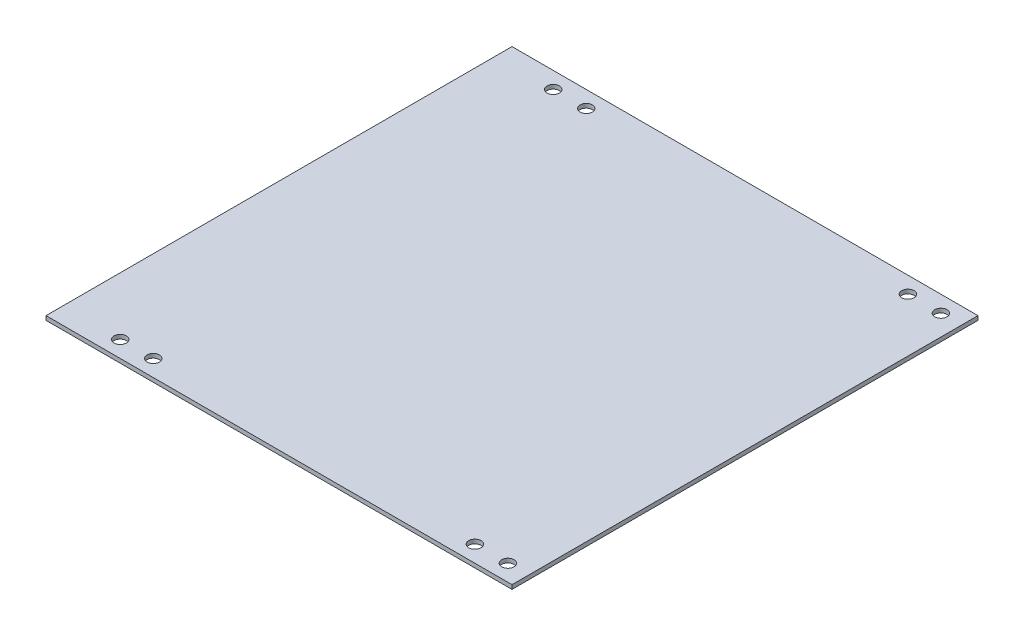
ISO-10303-21;
HEADER;
FILE_DESCRIPTION(('STEP AP214'),'2;1');
FILE_NAME('part.step','',(''),(''),'','','');
FILE_SCHEMA(('AUTOMOTIVE_DESIGN { 1 0 10303 214 1 1 1 1 }'));
ENDSEC;
DATA;
#1=APPLICATION_CONTEXT('core data for automotive mechanical design processes');
#2=APPLICATION_PROTOCOL_DEFINITION('international standard','automotive_design',2000,#1);
#3=PRODUCT_CONTEXT('',#1,'mechanical');
#4=PRODUCT('Part','Part','',(#3));
#5=PRODUCT_RELATED_PRODUCT_CATEGORY('part','',(#4));
#6=PRODUCT_DEFINITION_FORMATION('','',#4);
#7=PRODUCT_DEFINITION_CONTEXT('part definition',#1,'design');
#8=PRODUCT_DEFINITION('design','',#6,#7);
#9=PRODUCT_DEFINITION_SHAPE('','',#8);
#10=(LENGTH_UNIT() NAMED_UNIT(*) SI_UNIT(.MILLI.,.METRE.));
#11=(NAMED_UNIT(*) PLANE_ANGLE_UNIT() SI_UNIT($,.RADIAN.));
#12=(NAMED_UNIT(*) SI_UNIT($,.STERADIAN.) SOLID_ANGLE_UNIT());
#13=UNCERTAINTY_MEASURE_WITH_UNIT(LENGTH_MEASURE(1.E-05),#10,'distance_accuracy_value','');
#14=(GEOMETRIC_REPRESENTATION_CONTEXT(3) GLOBAL_UNCERTAINTY_ASSIGNED_CONTEXT((#13)) GLOBAL_UNIT_ASSIGNED_CONTEXT((#10,
#11,#12)) REPRESENTATION_CONTEXT('',''));
#15=CARTESIAN_POINT('',(0.,0.,0.));
#16=DIRECTION('',(0.,0.,1.));
#17=DIRECTION('',(1.,0.,0.));
#18=AXIS2_PLACEMENT_3D('',#15,#16,#17);
#19=CARTESIAN_POINT('',(0.,3.175,0.));
#20=DIRECTION('',(1.,0.,0.));
#21=DIRECTION('',(0.,0.,-1.));
#22=AXIS2_PLACEMENT_3D('',#19,#20,#21);
#23=PLANE('',#22);
#24=DIRECTION('',(0.,0.,1.));
#25=VECTOR('',#24,1.);
#26=CARTESIAN_POINT('',(0.,0.,0.));
#27=LINE('',#26,#25);
#28=CARTESIAN_POINT('',(0.,0.,-358.775));
#29=VERTEX_POINT('',#28);
#30=CARTESIAN_POINT('',(0.,0.,0.));
#31=VERTEX_POINT('',#30);
#32=EDGE_CURVE('E102',#29,#31,#27,.T.);
#33=ORIENTED_EDGE('',*,*,#32,.T.);
#34=DIRECTION('',(0.,-1.,0.));
#35=VECTOR('',#34,1.);
#36=CARTESIAN_POINT('',(0.,3.175,0.));
#37=LINE('',#36,#35);
#38=CARTESIAN_POINT('',(0.,3.175,0.));
#39=VERTEX_POINT('',#38);
#40=EDGE_CURVE('E11',#39,#31,#37,.T.);
#41=ORIENTED_EDGE('',*,*,#40,.F.);
#42=DIRECTION('',(0.,0.,1.));
#43=VECTOR('',#42,1.);
#44=CARTESIAN_POINT('',(0.,3.175,0.));
#45=LINE('',#44,#43);
#46=CARTESIAN_POINT('',(0.,3.175,-358.775));
#47=VERTEX_POINT('',#46);
#48=EDGE_CURVE('E90',#47,#39,#45,.T.);
#49=ORIENTED_EDGE('',*,*,#48,.F.);
#50=DIRECTION('',(0.,-1.,0.));
#51=VECTOR('',#50,1.);
#52=CARTESIAN_POINT('',(0.,3.175,-358.775));
#53=LINE('',#52,#51);
#54=EDGE_CURVE('E98',#47,#29,#53,.T.);
#55=ORIENTED_EDGE('',*,*,#54,.T.);
#56=EDGE_LOOP('',(#33,#41,#49,#55));
#57=FACE_BOUND('',#56,.T.);
#58=ADVANCED_FACE('F39',(#57),#23,.F.);
#59=CARTESIAN_POINT('',(0.,3.175,0.));
#60=DIRECTION('',(0.,0.,-1.));
#61=DIRECTION('',(-1.,0.,0.));
#62=AXIS2_PLACEMENT_3D('',#59,#60,#61);
#63=PLANE('',#62);
#64=DIRECTION('',(1.,0.,0.));
#65=VECTOR('',#64,1.);
#66=CARTESIAN_POINT('',(0.,0.,0.));
#67=LINE('',#66,#65);
#68=CARTESIAN_POINT('',(358.775,0.,0.));
#69=VERTEX_POINT('',#68);
#70=EDGE_CURVE('E94',#31,#69,#67,.T.);
#71=ORIENTED_EDGE('',*,*,#70,.T.);
#72=DIRECTION('',(0.,-1.,0.));
#73=VECTOR('',#72,1.);
#74=CARTESIAN_POINT('',(358.775,3.175,0.));
#75=LINE('',#74,#73);
#76=CARTESIAN_POINT('',(358.775,3.175,0.));
#77=VERTEX_POINT('',#76);
#78=EDGE_CURVE('E47',#77,#69,#75,.T.);
#79=ORIENTED_EDGE('',*,*,#78,.F.);
#80=DIRECTION('',(1.,0.,0.));
#81=VECTOR('',#80,1.);
#82=CARTESIAN_POINT('',(0.,3.175,0.));
#83=LINE('',#82,#81);
#84=EDGE_CURVE('E85',#39,#77,#83,.T.);
#85=ORIENTED_EDGE('',*,*,#84,.F.);
#86=ORIENTED_EDGE('',*,*,#40,.T.);
#87=EDGE_LOOP('',(#71,#79,#85,#86));
#88=FACE_BOUND('',#87,.T.);
#89=ADVANCED_FACE('F93',(#88),#63,.F.);
#90=CARTESIAN_POINT('',(358.775,3.175,0.));
#91=DIRECTION('',(-1.,0.,0.));
#92=DIRECTION('',(0.,0.,1.));
#93=AXIS2_PLACEMENT_3D('',#90,#91,#92);
#94=PLANE('',#93);
#95=DIRECTION('',(0.,0.,-1.));
#96=VECTOR('',#95,1.);
#97=CARTESIAN_POINT('',(358.775,0.,0.));
#98=LINE('',#97,#96);
#99=CARTESIAN_POINT('',(358.775,0.,-358.775));
#100=VERTEX_POINT('',#99);
#101=EDGE_CURVE('E72',#69,#100,#98,.T.);
#102=ORIENTED_EDGE('',*,*,#101,.T.);
#103=DIRECTION('',(0.,-1.,0.));
#104=VECTOR('',#103,1.);
#105=CARTESIAN_POINT('',(358.775,3.175,-358.775));
#106=LINE('',#105,#104);
#107=CARTESIAN_POINT('',(358.775,3.175,-358.775));
#108=VERTEX_POINT('',#107);
#109=EDGE_CURVE('E95',#108,#100,#106,.T.);
#110=ORIENTED_EDGE('',*,*,#109,.F.);
#111=DIRECTION('',(0.,0.,-1.));
#112=VECTOR('',#111,1.);
#113=CARTESIAN_POINT('',(358.775,3.175,0.));
#114=LINE('',#113,#112);
#115=EDGE_CURVE('E88',#77,#108,#114,.T.);
#116=ORIENTED_EDGE('',*,*,#115,.F.);
#117=ORIENTED_EDGE('',*,*,#78,.T.);
#118=EDGE_LOOP('',(#102,#110,#116,#117));
#119=FACE_BOUND('',#118,.T.);
#120=ADVANCED_FACE('F96',(#119),#94,.F.);
#121=CARTESIAN_POINT('',(0.,3.175,-358.775));
#122=DIRECTION('',(0.,0.,1.));
#123=DIRECTION('',(1.,0.,0.));
#124=AXIS2_PLACEMENT_3D('',#121,#122,#123);
#125=PLANE('',#124);
#126=DIRECTION('',(-1.,0.,0.));
#127=VECTOR('',#126,1.);
#128=CARTESIAN_POINT('',(0.,0.,-358.775));
#129=LINE('',#128,#127);
#130=EDGE_CURVE('E78',#100,#29,#129,.T.);
#131=ORIENTED_EDGE('',*,*,#130,.T.);
#132=ORIENTED_EDGE('',*,*,#54,.F.);
#133=DIRECTION('',(-1.,0.,0.));
#134=VECTOR('',#133,1.);
#135=CARTESIAN_POINT('',(0.,3.175,-358.775));
#136=LINE('',#135,#134);
#137=EDGE_CURVE('E55',#108,#47,#136,.T.);
#138=ORIENTED_EDGE('',*,*,#137,.F.);
#139=ORIENTED_EDGE('',*,*,#109,.T.);
#140=EDGE_LOOP('',(#131,#132,#138,#139));
#141=FACE_BOUND('',#140,.T.);
#142=ADVANCED_FACE('F110',(#141),#125,.F.);
#143=CARTESIAN_POINT('',(0.,3.175,0.));
#144=DIRECTION('',(0.,-1.,0.));
#145=DIRECTION('',(0.,0.,-1.));
#146=AXIS2_PLACEMENT_3D('',#143,#144,#145);
#147=PLANE('',#146);
#148=CARTESIAN_POINT('',(44.4500000000001,3.175,-346.075));
#149=DIRECTION('',(0.,-1.,0.));
#150=DIRECTION('',(0.,0.,-1.));
#151=AXIS2_PLACEMENT_3D('',#148,#149,#150);
#152=CIRCLE('',#151,4.7625);
#153=CARTESIAN_POINT('',(44.4500000000001,3.175,-350.8375));
#154=VERTEX_POINT('',#153);
#155=EDGE_CURVE('E158',#154,#154,#152,.T.);
#156=ORIENTED_EDGE('',*,*,#155,.T.);
#157=EDGE_LOOP('',(#156));
#158=FACE_BOUND('',#157,.T.);
#159=CARTESIAN_POINT('',(69.8500000000001,3.175,-346.075));
#160=DIRECTION('',(0.,-1.,0.));
#161=DIRECTION('',(0.,0.,-1.));
#162=AXIS2_PLACEMENT_3D('',#159,#160,#161);
#163=CIRCLE('',#162,4.7625);
#164=CARTESIAN_POINT('',(69.8500000000001,3.175,-350.8375));
#165=VERTEX_POINT('',#164);
#166=EDGE_CURVE('E152',#165,#165,#163,.T.);
#167=ORIENTED_EDGE('',*,*,#166,.T.);
#168=EDGE_LOOP('',(#167));
#169=FACE_BOUND('',#168,.T.);
#170=CARTESIAN_POINT('',(317.5,3.175,-346.075));
#171=DIRECTION('',(0.,-1.,0.));
#172=DIRECTION('',(0.,0.,-1.));
#173=AXIS2_PLACEMENT_3D('',#170,#171,#172);
#174=CIRCLE('',#173,4.76250000000001);
#175=CARTESIAN_POINT('',(317.5,3.175,-350.8375));
#176=VERTEX_POINT('',#175);
#177=EDGE_CURVE('E146',#176,#176,#174,.T.);
#178=ORIENTED_EDGE('',*,*,#177,.T.);
#179=EDGE_LOOP('',(#178));
#180=FACE_BOUND('',#179,.T.);
#181=CARTESIAN_POINT('',(342.9,3.175,-346.075));
#182=DIRECTION('',(0.,-1.,0.));
#183=DIRECTION('',(0.,0.,-1.));
#184=AXIS2_PLACEMENT_3D('',#181,#182,#183);
#185=CIRCLE('',#184,4.76250000000001);
#186=CARTESIAN_POINT('',(342.9,3.175,-350.8375));
#187=VERTEX_POINT('',#186);
#188=EDGE_CURVE('E140',#187,#187,#185,.T.);
#189=ORIENTED_EDGE('',*,*,#188,.T.);
#190=EDGE_LOOP('',(#189));
#191=FACE_BOUND('',#190,.T.);
#192=CARTESIAN_POINT('',(44.4500000000001,3.175,-12.7));
#193=DIRECTION('',(0.,1.,0.));
#194=DIRECTION('',(0.,0.,1.));
#195=AXIS2_PLACEMENT_3D('',#192,#193,#194);
#196=CIRCLE('',#195,4.7625);
#197=CARTESIAN_POINT('',(44.4500000000001,3.175,-7.9375));
#198=VERTEX_POINT('',#197);
#199=EDGE_CURVE('E135',#198,#198,#196,.T.);
#200=ORIENTED_EDGE('',*,*,#199,.F.);
#201=EDGE_LOOP('',(#200));
#202=FACE_BOUND('',#201,.T.);
#203=CARTESIAN_POINT('',(69.8500000000001,3.175,-12.7000000000001));
#204=DIRECTION('',(0.,1.,0.));
#205=DIRECTION('',(0.,0.,1.));
#206=AXIS2_PLACEMENT_3D('',#203,#204,#205);
#207=CIRCLE('',#206,4.7625);
#208=CARTESIAN_POINT('',(69.8500000000001,3.175,-7.93750000000006));
#209=VERTEX_POINT('',#208);
#210=EDGE_CURVE('E129',#209,#209,#207,.T.);
#211=ORIENTED_EDGE('',*,*,#210,.F.);
#212=EDGE_LOOP('',(#211));
#213=FACE_BOUND('',#212,.T.);
#214=CARTESIAN_POINT('',(317.5,3.175,-12.7));
#215=DIRECTION('',(0.,1.,0.));
#216=DIRECTION('',(0.,0.,1.));
#217=AXIS2_PLACEMENT_3D('',#214,#215,#216);
#218=CIRCLE('',#217,4.76250000000001);
#219=CARTESIAN_POINT('',(317.5,3.175,-7.93749999999999));
#220=VERTEX_POINT('',#219);
#221=EDGE_CURVE('E123',#220,#220,#218,.T.);
#222=ORIENTED_EDGE('',*,*,#221,.F.);
#223=EDGE_LOOP('',(#222));
#224=FACE_BOUND('',#223,.T.);
#225=CARTESIAN_POINT('',(342.9,3.175,-12.7));
#226=DIRECTION('',(0.,1.,0.));
#227=DIRECTION('',(0.,0.,1.));
#228=AXIS2_PLACEMENT_3D('',#225,#226,#227);
#229=CIRCLE('',#228,4.76250000000001);
#230=CARTESIAN_POINT('',(342.9,3.175,-7.93749999999999));
#231=VERTEX_POINT('',#230);
#232=EDGE_CURVE('E116',#231,#231,#229,.T.);
#233=ORIENTED_EDGE('',*,*,#232,.F.);
#234=EDGE_LOOP('',(#233));
#235=FACE_BOUND('',#234,.T.);
#236=ORIENTED_EDGE('',*,*,#48,.T.);
#237=ORIENTED_EDGE('',*,*,#84,.T.);
#238=ORIENTED_EDGE('',*,*,#115,.T.);
#239=ORIENTED_EDGE('',*,*,#137,.T.);
#240=EDGE_LOOP('',(#236,#237,#238,#239));
#241=FACE_BOUND('',#240,.T.);
#242=ADVANCED_FACE('F86',(#158,#169,#180,#191,#202,#213,#224,#235,#241),#147,.F.);
#243=CARTESIAN_POINT('',(0.,0.,0.));
#244=DIRECTION('',(0.,-1.,0.));
#245=DIRECTION('',(0.,0.,-1.));
#246=AXIS2_PLACEMENT_3D('',#243,#244,#245);
#247=PLANE('',#246);
#248=CARTESIAN_POINT('',(44.4500000000001,0.,-346.075));
#249=DIRECTION('',(0.,-1.,0.));
#250=DIRECTION('',(0.,0.,-1.));
#251=AXIS2_PLACEMENT_3D('',#248,#249,#250);
#252=CIRCLE('',#251,4.7625);
#253=CARTESIAN_POINT('',(44.4500000000001,0.,-350.8375));
#254=VERTEX_POINT('',#253);
#255=EDGE_CURVE('E120',#254,#254,#252,.T.);
#256=ORIENTED_EDGE('',*,*,#255,.F.);
#257=EDGE_LOOP('',(#256));
#258=FACE_BOUND('',#257,.T.);
#259=CARTESIAN_POINT('',(69.8500000000001,0.,-346.075));
#260=DIRECTION('',(0.,-1.,0.));
#261=DIRECTION('',(0.,0.,-1.));
#262=AXIS2_PLACEMENT_3D('',#259,#260,#261);
#263=CIRCLE('',#262,4.7625);
#264=CARTESIAN_POINT('',(69.8500000000001,0.,-350.8375));
#265=VERTEX_POINT('',#264);
#266=EDGE_CURVE('E155',#265,#265,#263,.T.);
#267=ORIENTED_EDGE('',*,*,#266,.F.);
#268=EDGE_LOOP('',(#267));
#269=FACE_BOUND('',#268,.T.);
#270=CARTESIAN_POINT('',(317.5,0.,-346.075));
#271=DIRECTION('',(0.,-1.,0.));
#272=DIRECTION('',(0.,0.,-1.));
#273=AXIS2_PLACEMENT_3D('',#270,#271,#272);
#274=CIRCLE('',#273,4.76250000000001);
#275=CARTESIAN_POINT('',(317.5,0.,-350.8375));
#276=VERTEX_POINT('',#275);
#277=EDGE_CURVE('E149',#276,#276,#274,.T.);
#278=ORIENTED_EDGE('',*,*,#277,.F.);
#279=EDGE_LOOP('',(#278));
#280=FACE_BOUND('',#279,.T.);
#281=CARTESIAN_POINT('',(342.9,0.,-346.075));
#282=DIRECTION('',(0.,-1.,0.));
#283=DIRECTION('',(0.,0.,-1.));
#284=AXIS2_PLACEMENT_3D('',#281,#282,#283);
#285=CIRCLE('',#284,4.76250000000001);
#286=CARTESIAN_POINT('',(342.9,0.,-350.8375));
#287=VERTEX_POINT('',#286);
#288=EDGE_CURVE('E143',#287,#287,#285,.T.);
#289=ORIENTED_EDGE('',*,*,#288,.F.);
#290=EDGE_LOOP('',(#289));
#291=FACE_BOUND('',#290,.T.);
#292=CARTESIAN_POINT('',(44.4500000000001,0.,-12.7));
#293=DIRECTION('',(0.,1.,0.));
#294=DIRECTION('',(0.,0.,1.));
#295=AXIS2_PLACEMENT_3D('',#292,#293,#294);
#296=CIRCLE('',#295,4.7625);
#297=CARTESIAN_POINT('',(44.4500000000001,0.,-7.9375));
#298=VERTEX_POINT('',#297);
#299=EDGE_CURVE('E105',#298,#298,#296,.T.);
#300=ORIENTED_EDGE('',*,*,#299,.T.);
#301=EDGE_LOOP('',(#300));
#302=FACE_BOUND('',#301,.T.);
#303=CARTESIAN_POINT('',(69.8500000000001,0.,-12.7000000000001));
#304=DIRECTION('',(0.,1.,0.));
#305=DIRECTION('',(0.,0.,1.));
#306=AXIS2_PLACEMENT_3D('',#303,#304,#305);
#307=CIRCLE('',#306,4.7625);
#308=CARTESIAN_POINT('',(69.8500000000001,0.,-7.93750000000006));
#309=VERTEX_POINT('',#308);
#310=EDGE_CURVE('E132',#309,#309,#307,.T.);
#311=ORIENTED_EDGE('',*,*,#310,.T.);
#312=EDGE_LOOP('',(#311));
#313=FACE_BOUND('',#312,.T.);
#314=CARTESIAN_POINT('',(317.5,0.,-12.7));
#315=DIRECTION('',(0.,1.,0.));
#316=DIRECTION('',(0.,0.,1.));
#317=AXIS2_PLACEMENT_3D('',#314,#315,#316);
#318=CIRCLE('',#317,4.76250000000001);
#319=CARTESIAN_POINT('',(317.5,0.,-7.93749999999999));
#320=VERTEX_POINT('',#319);
#321=EDGE_CURVE('E126',#320,#320,#318,.T.);
#322=ORIENTED_EDGE('',*,*,#321,.T.);
#323=EDGE_LOOP('',(#322));
#324=FACE_BOUND('',#323,.T.);
#325=CARTESIAN_POINT('',(342.9,0.,-12.7));
#326=DIRECTION('',(0.,1.,0.));
#327=DIRECTION('',(0.,0.,1.));
#328=AXIS2_PLACEMENT_3D('',#325,#326,#327);
#329=CIRCLE('',#328,4.76250000000001);
#330=CARTESIAN_POINT('',(342.9,0.,-7.93749999999999));
#331=VERTEX_POINT('',#330);
#332=EDGE_CURVE('E119',#331,#331,#329,.T.);
#333=ORIENTED_EDGE('',*,*,#332,.T.);
#334=EDGE_LOOP('',(#333));
#335=FACE_BOUND('',#334,.T.);
#336=ORIENTED_EDGE('',*,*,#32,.F.);
#337=ORIENTED_EDGE('',*,*,#130,.F.);
#338=ORIENTED_EDGE('',*,*,#101,.F.);
#339=ORIENTED_EDGE('',*,*,#70,.F.);
#340=EDGE_LOOP('',(#336,#337,#338,#339));
#341=FACE_BOUND('',#340,.T.);
#342=ADVANCED_FACE('F113',(#258,#269,#280,#291,#302,#313,#324,#335,#341),#247,.T.);
#343=CARTESIAN_POINT('',(342.9,0.,-12.7));
#344=DIRECTION('',(0.,1.,0.));
#345=DIRECTION('',(0.,0.,1.));
#346=AXIS2_PLACEMENT_3D('',#343,#344,#345);
#347=CYLINDRICAL_SURFACE('',#346,4.76250000000001);
#348=ORIENTED_EDGE('',*,*,#332,.F.);
#349=EDGE_LOOP('',(#348));
#350=FACE_BOUND('',#349,.T.);
#351=ORIENTED_EDGE('',*,*,#232,.T.);
#352=EDGE_LOOP('',(#351));
#353=FACE_BOUND('',#352,.T.);
#354=ADVANCED_FACE('F169',(#350,#353),#347,.F.);
#355=CARTESIAN_POINT('',(317.5,0.,-12.7));
#356=DIRECTION('',(0.,1.,0.));
#357=DIRECTION('',(0.,0.,1.));
#358=AXIS2_PLACEMENT_3D('',#355,#356,#357);
#359=CYLINDRICAL_SURFACE('',#358,4.76250000000001);
#360=ORIENTED_EDGE('',*,*,#321,.F.);
#361=EDGE_LOOP('',(#360));
#362=FACE_BOUND('',#361,.T.);
#363=ORIENTED_EDGE('',*,*,#221,.T.);
#364=EDGE_LOOP('',(#363));
#365=FACE_BOUND('',#364,.T.);
#366=ADVANCED_FACE('F187',(#362,#365),#359,.F.);
#367=CARTESIAN_POINT('',(69.8500000000001,0.,-12.7000000000001));
#368=DIRECTION('',(0.,1.,0.));
#369=DIRECTION('',(0.,0.,1.));
#370=AXIS2_PLACEMENT_3D('',#367,#368,#369);
#371=CYLINDRICAL_SURFACE('',#370,4.7625);
#372=ORIENTED_EDGE('',*,*,#310,.F.);
#373=EDGE_LOOP('',(#372));
#374=FACE_BOUND('',#373,.T.);
#375=ORIENTED_EDGE('',*,*,#210,.T.);
#376=EDGE_LOOP('',(#375));
#377=FACE_BOUND('',#376,.T.);
#378=ADVANCED_FACE('F230',(#374,#377),#371,.F.);
#379=CARTESIAN_POINT('',(44.4500000000001,0.,-12.7));
#380=DIRECTION('',(0.,1.,0.));
#381=DIRECTION('',(0.,0.,1.));
#382=AXIS2_PLACEMENT_3D('',#379,#380,#381);
#383=CYLINDRICAL_SURFACE('',#382,4.7625);
#384=ORIENTED_EDGE('',*,*,#299,.F.);
#385=EDGE_LOOP('',(#384));
#386=FACE_BOUND('',#385,.T.);
#387=ORIENTED_EDGE('',*,*,#199,.T.);
#388=EDGE_LOOP('',(#387));
#389=FACE_BOUND('',#388,.T.);
#390=ADVANCED_FACE('F240',(#386,#389),#383,.F.);
#391=CARTESIAN_POINT('',(342.9,0.,-346.075));
#392=DIRECTION('',(0.,1.,0.));
#393=DIRECTION('',(0.,0.,1.));
#394=AXIS2_PLACEMENT_3D('',#391,#392,#393);
#395=CYLINDRICAL_SURFACE('',#394,4.76250000000001);
#396=ORIENTED_EDGE('',*,*,#288,.T.);
#397=EDGE_LOOP('',(#396));
#398=FACE_BOUND('',#397,.T.);
#399=ORIENTED_EDGE('',*,*,#188,.F.);
#400=EDGE_LOOP('',(#399));
#401=FACE_BOUND('',#400,.T.);
#402=ADVANCED_FACE('F249',(#398,#401),#395,.F.);
#403=CARTESIAN_POINT('',(317.5,0.,-346.075));
#404=DIRECTION('',(0.,1.,0.));
#405=DIRECTION('',(0.,0.,1.));
#406=AXIS2_PLACEMENT_3D('',#403,#404,#405);
#407=CYLINDRICAL_SURFACE('',#406,4.76250000000001);
#408=ORIENTED_EDGE('',*,*,#277,.T.);
#409=EDGE_LOOP('',(#408));
#410=FACE_BOUND('',#409,.T.);
#411=ORIENTED_EDGE('',*,*,#177,.F.);
#412=EDGE_LOOP('',(#411));
#413=FACE_BOUND('',#412,.T.);
#414=ADVANCED_FACE('F268',(#410,#413),#407,.F.);
#415=CARTESIAN_POINT('',(69.8500000000001,0.,-346.075));
#416=DIRECTION('',(0.,1.,0.));
#417=DIRECTION('',(0.,0.,1.));
#418=AXIS2_PLACEMENT_3D('',#415,#416,#417);
#419=CYLINDRICAL_SURFACE('',#418,4.7625);
#420=ORIENTED_EDGE('',*,*,#266,.T.);
#421=EDGE_LOOP('',(#420));
#422=FACE_BOUND('',#421,.T.);
#423=ORIENTED_EDGE('',*,*,#166,.F.);
#424=EDGE_LOOP('',(#423));
#425=FACE_BOUND('',#424,.T.);
#426=ADVANCED_FACE('F278',(#422,#425),#419,.F.);
#427=CARTESIAN_POINT('',(44.4500000000001,0.,-346.075));
#428=DIRECTION('',(0.,1.,0.));
#429=DIRECTION('',(0.,0.,1.));
#430=AXIS2_PLACEMENT_3D('',#427,#428,#429);
#431=CYLINDRICAL_SURFACE('',#430,4.7625);
#432=ORIENTED_EDGE('',*,*,#255,.T.);
#433=EDGE_LOOP('',(#432));
#434=FACE_BOUND('',#433,.T.);
#435=ORIENTED_EDGE('',*,*,#155,.F.);
#436=EDGE_LOOP('',(#435));
#437=FACE_BOUND('',#436,.T.);
#438=ADVANCED_FACE('F164',(#434,#437),#431,.F.);
#439=CLOSED_SHELL('',(#58,#89,#120,#142,#242,#342,#354,#366,#378,#390,#402,#414,#426,#438));
#440=MANIFOLD_SOLID_BREP('B2',#439);
#441=ADVANCED_BREP_SHAPE_REPRESENTATION('',(#18,#440),#14);
#442=SHAPE_DEFINITION_REPRESENTATION(#9,#441);
ENDSEC;
END-ISO-10303-21;
